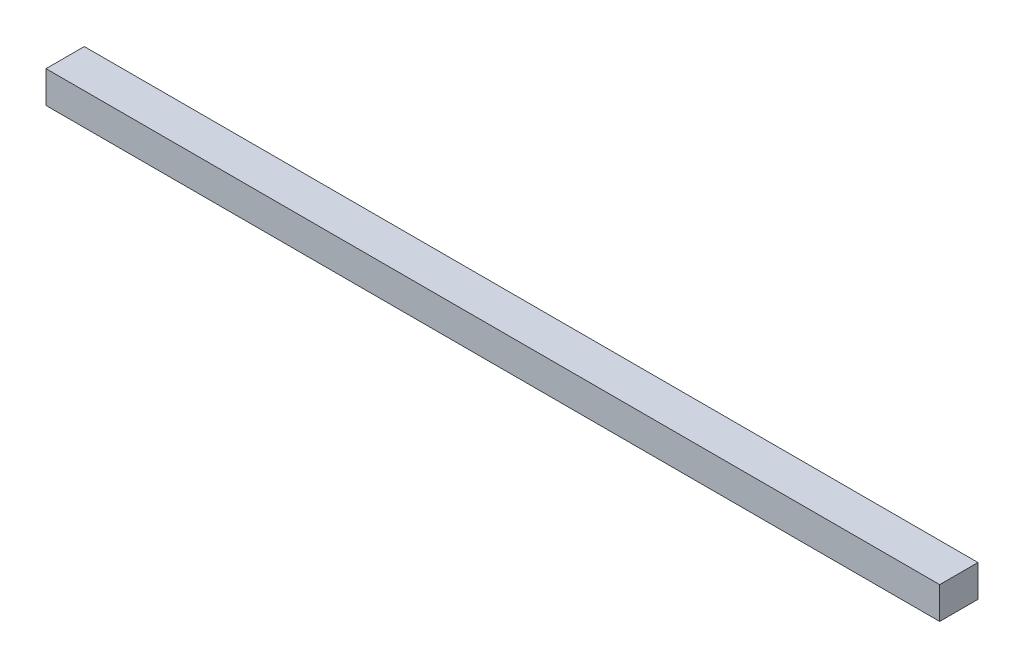
ISO-10303-21;
HEADER;
FILE_DESCRIPTION(('STEP AP214'),'2;1');
FILE_NAME('part.step','',(''),(''),'','','');
FILE_SCHEMA(('AUTOMOTIVE_DESIGN { 1 0 10303 214 1 1 1 1 }'));
ENDSEC;
DATA;
#1=APPLICATION_CONTEXT('core data for automotive mechanical design processes');
#2=APPLICATION_PROTOCOL_DEFINITION('international standard','automotive_design',2000,#1);
#3=PRODUCT_CONTEXT('',#1,'mechanical');
#4=PRODUCT('Part','Part','',(#3));
#5=PRODUCT_RELATED_PRODUCT_CATEGORY('part','',(#4));
#6=PRODUCT_DEFINITION_FORMATION('','',#4);
#7=PRODUCT_DEFINITION_CONTEXT('part definition',#1,'design');
#8=PRODUCT_DEFINITION('design','',#6,#7);
#9=PRODUCT_DEFINITION_SHAPE('','',#8);
#10=(LENGTH_UNIT() NAMED_UNIT(*) SI_UNIT(.MILLI.,.METRE.));
#11=(NAMED_UNIT(*) PLANE_ANGLE_UNIT() SI_UNIT($,.RADIAN.));
#12=(NAMED_UNIT(*) SI_UNIT($,.STERADIAN.) SOLID_ANGLE_UNIT());
#13=UNCERTAINTY_MEASURE_WITH_UNIT(LENGTH_MEASURE(1.E-05),#10,'distance_accuracy_value','');
#14=(GEOMETRIC_REPRESENTATION_CONTEXT(3) GLOBAL_UNCERTAINTY_ASSIGNED_CONTEXT((#13)) GLOBAL_UNIT_ASSIGNED_CONTEXT((#10,
#11,#12)) REPRESENTATION_CONTEXT('',''));
#15=CARTESIAN_POINT('',(0.,0.,0.));
#16=DIRECTION('',(0.,0.,1.));
#17=DIRECTION('',(1.,0.,0.));
#18=AXIS2_PLACEMENT_3D('',#15,#16,#17);
#19=CARTESIAN_POINT('',(700.,0.,0.));
#20=DIRECTION('',(0.,0.,-1.));
#21=DIRECTION('',(0.,1.,0.));
#22=AXIS2_PLACEMENT_3D('',#19,#20,#21);
#23=PLANE('',#22);
#24=DIRECTION('',(0.,-1.,0.));
#25=VECTOR('',#24,1.);
#26=CARTESIAN_POINT('',(0.,0.,0.));
#27=LINE('',#26,#25);
#28=CARTESIAN_POINT('',(0.,25.,0.));
#29=VERTEX_POINT('',#28);
#30=CARTESIAN_POINT('',(0.,0.,0.));
#31=VERTEX_POINT('',#30);
#32=EDGE_CURVE('E96',#29,#31,#27,.T.);
#33=ORIENTED_EDGE('',*,*,#32,.T.);
#34=DIRECTION('',(-1.,0.,0.));
#35=VECTOR('',#34,1.);
#36=CARTESIAN_POINT('',(700.,0.,0.));
#37=LINE('',#36,#35);
#38=CARTESIAN_POINT('',(700.,0.,0.));
#39=VERTEX_POINT('',#38);
#40=EDGE_CURVE('E11',#39,#31,#37,.T.);
#41=ORIENTED_EDGE('',*,*,#40,.F.);
#42=DIRECTION('',(0.,-1.,0.));
#43=VECTOR('',#42,1.);
#44=CARTESIAN_POINT('',(700.,0.,0.));
#45=LINE('',#44,#43);
#46=CARTESIAN_POINT('',(700.,25.,0.));
#47=VERTEX_POINT('',#46);
#48=EDGE_CURVE('E84',#47,#39,#45,.T.);
#49=ORIENTED_EDGE('',*,*,#48,.F.);
#50=DIRECTION('',(-1.,0.,0.));
#51=VECTOR('',#50,1.);
#52=CARTESIAN_POINT('',(700.,25.,0.));
#53=LINE('',#52,#51);
#54=EDGE_CURVE('E92',#47,#29,#53,.T.);
#55=ORIENTED_EDGE('',*,*,#54,.T.);
#56=EDGE_LOOP('',(#33,#41,#49,#55));
#57=FACE_BOUND('',#56,.T.);
#58=ADVANCED_FACE('F33',(#57),#23,.F.);
#59=CARTESIAN_POINT('',(700.,0.,0.));
#60=DIRECTION('',(0.,1.,0.));
#61=DIRECTION('',(0.,0.,1.));
#62=AXIS2_PLACEMENT_3D('',#59,#60,#61);
#63=PLANE('',#62);
#64=DIRECTION('',(0.,0.,-1.));
#65=VECTOR('',#64,1.);
#66=CARTESIAN_POINT('',(0.,0.,0.));
#67=LINE('',#66,#65);
#68=CARTESIAN_POINT('',(0.,0.,-30.));
#69=VERTEX_POINT('',#68);
#70=EDGE_CURVE('E88',#31,#69,#67,.T.);
#71=ORIENTED_EDGE('',*,*,#70,.T.);
#72=DIRECTION('',(-1.,0.,0.));
#73=VECTOR('',#72,1.);
#74=CARTESIAN_POINT('',(700.,0.,-30.));
#75=LINE('',#74,#73);
#76=CARTESIAN_POINT('',(700.,0.,-30.));
#77=VERTEX_POINT('',#76);
#78=EDGE_CURVE('E41',#77,#69,#75,.T.);
#79=ORIENTED_EDGE('',*,*,#78,.F.);
#80=DIRECTION('',(0.,0.,-1.));
#81=VECTOR('',#80,1.);
#82=CARTESIAN_POINT('',(700.,0.,0.));
#83=LINE('',#82,#81);
#84=EDGE_CURVE('E79',#39,#77,#83,.T.);
#85=ORIENTED_EDGE('',*,*,#84,.F.);
#86=ORIENTED_EDGE('',*,*,#40,.T.);
#87=EDGE_LOOP('',(#71,#79,#85,#86));
#88=FACE_BOUND('',#87,.T.);
#89=ADVANCED_FACE('F87',(#88),#63,.F.);
#90=CARTESIAN_POINT('',(700.,0.,-30.));
#91=DIRECTION('',(0.,0.,1.));
#92=DIRECTION('',(0.,-1.,0.));
#93=AXIS2_PLACEMENT_3D('',#90,#91,#92);
#94=PLANE('',#93);
#95=DIRECTION('',(0.,1.,0.));
#96=VECTOR('',#95,1.);
#97=CARTESIAN_POINT('',(0.,0.,-30.));
#98=LINE('',#97,#96);
#99=CARTESIAN_POINT('',(0.,25.,-30.));
#100=VERTEX_POINT('',#99);
#101=EDGE_CURVE('E66',#69,#100,#98,.T.);
#102=ORIENTED_EDGE('',*,*,#101,.T.);
#103=DIRECTION('',(-1.,0.,0.));
#104=VECTOR('',#103,1.);
#105=CARTESIAN_POINT('',(700.,25.,-30.));
#106=LINE('',#105,#104);
#107=CARTESIAN_POINT('',(700.,25.,-30.));
#108=VERTEX_POINT('',#107);
#109=EDGE_CURVE('E89',#108,#100,#106,.T.);
#110=ORIENTED_EDGE('',*,*,#109,.F.);
#111=DIRECTION('',(0.,1.,0.));
#112=VECTOR('',#111,1.);
#113=CARTESIAN_POINT('',(700.,0.,-30.));
#114=LINE('',#113,#112);
#115=EDGE_CURVE('E82',#77,#108,#114,.T.);
#116=ORIENTED_EDGE('',*,*,#115,.F.);
#117=ORIENTED_EDGE('',*,*,#78,.T.);
#118=EDGE_LOOP('',(#102,#110,#116,#117));
#119=FACE_BOUND('',#118,.T.);
#120=ADVANCED_FACE('F90',(#119),#94,.F.);
#121=CARTESIAN_POINT('',(700.,25.,0.));
#122=DIRECTION('',(0.,-1.,0.));
#123=DIRECTION('',(0.,0.,-1.));
#124=AXIS2_PLACEMENT_3D('',#121,#122,#123);
#125=PLANE('',#124);
#126=DIRECTION('',(0.,0.,1.));
#127=VECTOR('',#126,1.);
#128=CARTESIAN_POINT('',(0.,25.,0.));
#129=LINE('',#128,#127);
#130=EDGE_CURVE('E72',#100,#29,#129,.T.);
#131=ORIENTED_EDGE('',*,*,#130,.T.);
#132=ORIENTED_EDGE('',*,*,#54,.F.);
#133=DIRECTION('',(0.,0.,1.));
#134=VECTOR('',#133,1.);
#135=CARTESIAN_POINT('',(700.,25.,0.));
#136=LINE('',#135,#134);
#137=EDGE_CURVE('E49',#108,#47,#136,.T.);
#138=ORIENTED_EDGE('',*,*,#137,.F.);
#139=ORIENTED_EDGE('',*,*,#109,.T.);
#140=EDGE_LOOP('',(#131,#132,#138,#139));
#141=FACE_BOUND('',#140,.T.);
#142=ADVANCED_FACE('F103',(#141),#125,.F.);
#143=CARTESIAN_POINT('',(700.,0.,0.));
#144=DIRECTION('',(-1.,0.,0.));
#145=DIRECTION('',(0.,0.,1.));
#146=AXIS2_PLACEMENT_3D('',#143,#144,#145);
#147=PLANE('',#146);
#148=ORIENTED_EDGE('',*,*,#48,.T.);
#149=ORIENTED_EDGE('',*,*,#84,.T.);
#150=ORIENTED_EDGE('',*,*,#115,.T.);
#151=ORIENTED_EDGE('',*,*,#137,.T.);
#152=EDGE_LOOP('',(#148,#149,#150,#151));
#153=FACE_BOUND('',#152,.T.);
#154=ADVANCED_FACE('F80',(#153),#147,.F.);
#155=CARTESIAN_POINT('',(0.,0.,0.));
#156=DIRECTION('',(-1.,0.,0.));
#157=DIRECTION('',(0.,0.,1.));
#158=AXIS2_PLACEMENT_3D('',#155,#156,#157);
#159=PLANE('',#158);
#160=ORIENTED_EDGE('',*,*,#32,.F.);
#161=ORIENTED_EDGE('',*,*,#130,.F.);
#162=ORIENTED_EDGE('',*,*,#101,.F.);
#163=ORIENTED_EDGE('',*,*,#70,.F.);
#164=EDGE_LOOP('',(#160,#161,#162,#163));
#165=FACE_BOUND('',#164,.T.);
#166=ADVANCED_FACE('F106',(#165),#159,.T.);
#167=CLOSED_SHELL('',(#58,#89,#120,#142,#154,#166));
#168=MANIFOLD_SOLID_BREP('B2',#167);
#169=ADVANCED_BREP_SHAPE_REPRESENTATION('',(#18,#168),#14);
#170=SHAPE_DEFINITION_REPRESENTATION(#9,#169);
ENDSEC;
END-ISO-10303-21;
